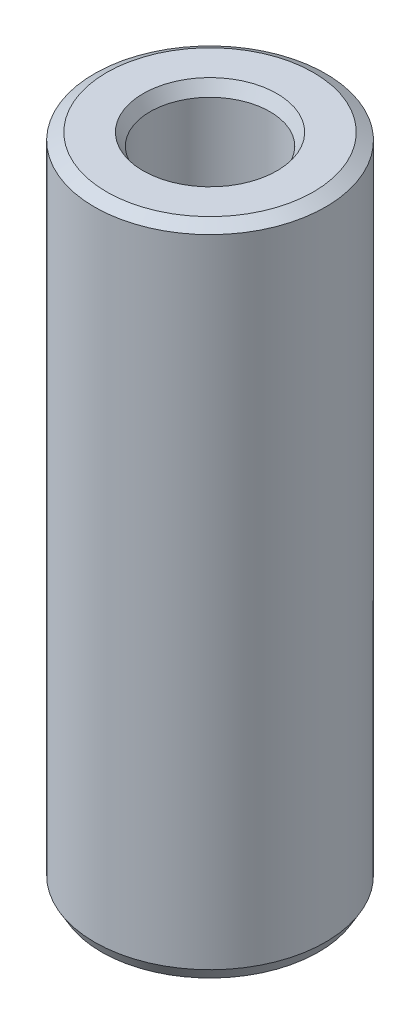
ISO-10303-21;
HEADER;
FILE_DESCRIPTION(('STEP AP214'),'2;1');
FILE_NAME('part.step','',(''),(''),'','','');
FILE_SCHEMA(('AUTOMOTIVE_DESIGN { 1 0 10303 214 1 1 1 1 }'));
ENDSEC;
DATA;
#1=APPLICATION_CONTEXT('core data for automotive mechanical design processes');
#2=APPLICATION_PROTOCOL_DEFINITION('international standard','automotive_design',2000,#1);
#3=PRODUCT_CONTEXT('',#1,'mechanical');
#4=PRODUCT('Part','Part','',(#3));
#5=PRODUCT_RELATED_PRODUCT_CATEGORY('part','',(#4));
#6=PRODUCT_DEFINITION_FORMATION('','',#4);
#7=PRODUCT_DEFINITION_CONTEXT('part definition',#1,'design');
#8=PRODUCT_DEFINITION('design','',#6,#7);
#9=PRODUCT_DEFINITION_SHAPE('','',#8);
#10=(LENGTH_UNIT() NAMED_UNIT(*) SI_UNIT(.MILLI.,.METRE.));
#11=(NAMED_UNIT(*) PLANE_ANGLE_UNIT() SI_UNIT($,.RADIAN.));
#12=(NAMED_UNIT(*) SI_UNIT($,.STERADIAN.) SOLID_ANGLE_UNIT());
#13=UNCERTAINTY_MEASURE_WITH_UNIT(LENGTH_MEASURE(1.E-05),#10,'distance_accuracy_value','');
#14=(GEOMETRIC_REPRESENTATION_CONTEXT(3) GLOBAL_UNCERTAINTY_ASSIGNED_CONTEXT((#13)) GLOBAL_UNIT_ASSIGNED_CONTEXT((#10,
#11,#12)) REPRESENTATION_CONTEXT('',''));
#15=CARTESIAN_POINT('',(0.,0.,0.));
#16=DIRECTION('',(0.,0.,1.));
#17=DIRECTION('',(1.,0.,0.));
#18=AXIS2_PLACEMENT_3D('',#15,#16,#17);
#19=CARTESIAN_POINT('',(0.,113.487181821992,0.));
#20=DIRECTION('',(0.,-1.,0.));
#21=DIRECTION('',(0.,0.,-1.));
#22=AXIS2_PLACEMENT_3D('',#19,#20,#21);
#23=CYLINDRICAL_SURFACE('',#22,20.);
#24=CARTESIAN_POINT('',(0.,2.10228948765961,0.));
#25=DIRECTION('',(0.,1.,0.));
#26=DIRECTION('',(0.,0.,1.));
#27=AXIS2_PLACEMENT_3D('',#24,#25,#26);
#28=CIRCLE('',#27,20.);
#29=CARTESIAN_POINT('',(0.,2.10228948765961,20.));
#30=VERTEX_POINT('',#29);
#31=EDGE_CURVE('E10',#30,#30,#28,.T.);
#32=ORIENTED_EDGE('',*,*,#31,.T.);
#33=EDGE_LOOP('',(#32));
#34=FACE_BOUND('',#33,.T.);
#35=CARTESIAN_POINT('',(0.,112.273424420377,0.));
#36=DIRECTION('',(0.,1.,0.));
#37=DIRECTION('',(0.,0.,1.));
#38=AXIS2_PLACEMENT_3D('',#35,#36,#37);
#39=CIRCLE('',#38,20.);
#40=CARTESIAN_POINT('',(0.,112.273424420377,20.));
#41=VERTEX_POINT('',#40);
#42=EDGE_CURVE('E50',#41,#41,#39,.F.);
#43=ORIENTED_EDGE('',*,*,#42,.T.);
#44=EDGE_LOOP('',(#43));
#45=FACE_BOUND('',#44,.T.);
#46=ADVANCED_FACE('F39',(#34,#45),#23,.T.);
#47=CARTESIAN_POINT('',(0.,113.487181821992,0.));
#48=DIRECTION('',(0.,1.,0.));
#49=DIRECTION('',(0.,0.,1.));
#50=AXIS2_PLACEMENT_3D('',#47,#48,#49);
#51=PLANE('',#50);
#52=CARTESIAN_POINT('',(0.,113.487181821992,0.));
#53=DIRECTION('',(0.,1.,0.));
#54=DIRECTION('',(0.,0.,1.));
#55=AXIS2_PLACEMENT_3D('',#52,#53,#54);
#56=CIRCLE('',#55,11.58377406442);
#57=CARTESIAN_POINT('',(0.,113.487181821992,11.58377406442));
#58=VERTEX_POINT('',#57);
#59=EDGE_CURVE('E58',#58,#58,#56,.F.);
#60=ORIENTED_EDGE('',*,*,#59,.T.);
#61=EDGE_LOOP('',(#60));
#62=FACE_BOUND('',#61,.T.);
#63=CARTESIAN_POINT('',(0.,113.487181821992,0.));
#64=DIRECTION('',(0.,1.,0.));
#65=DIRECTION('',(0.,0.,1.));
#66=AXIS2_PLACEMENT_3D('',#63,#64,#65);
#67=CIRCLE('',#66,17.8977105123403);
#68=CARTESIAN_POINT('',(0.,113.487181821992,17.8977105123403));
#69=VERTEX_POINT('',#68);
#70=EDGE_CURVE('E61',#69,#69,#67,.T.);
#71=ORIENTED_EDGE('',*,*,#70,.T.);
#72=EDGE_LOOP('',(#71));
#73=FACE_BOUND('',#72,.T.);
#74=ADVANCED_FACE('F88',(#62,#73),#51,.T.);
#75=CARTESIAN_POINT('',(0.,0.,0.));
#76=DIRECTION('',(0.,1.,0.));
#77=DIRECTION('',(0.,0.,1.));
#78=AXIS2_PLACEMENT_3D('',#75,#76,#77);
#79=PLANE('',#78);
#80=CARTESIAN_POINT('',(0.,0.,0.));
#81=DIRECTION('',(0.,1.,0.));
#82=DIRECTION('',(0.,0.,1.));
#83=AXIS2_PLACEMENT_3D('',#80,#81,#82);
#84=CIRCLE('',#83,12.4723061504648);
#85=CARTESIAN_POINT('',(0.,0.,12.4723061504648));
#86=VERTEX_POINT('',#85);
#87=EDGE_CURVE('E51',#86,#86,#84,.T.);
#88=ORIENTED_EDGE('',*,*,#87,.T.);
#89=EDGE_LOOP('',(#88));
#90=FACE_BOUND('',#89,.T.);
#91=CARTESIAN_POINT('',(0.,0.,0.));
#92=DIRECTION('',(0.,1.,0.));
#93=DIRECTION('',(0.,0.,1.));
#94=AXIS2_PLACEMENT_3D('',#91,#92,#93);
#95=CIRCLE('',#94,18.7862425983852);
#96=CARTESIAN_POINT('',(0.,0.,18.7862425983852));
#97=VERTEX_POINT('',#96);
#98=EDGE_CURVE('E54',#97,#97,#95,.F.);
#99=ORIENTED_EDGE('',*,*,#98,.T.);
#100=EDGE_LOOP('',(#99));
#101=FACE_BOUND('',#100,.T.);
#102=ADVANCED_FACE('F83',(#90,#101),#79,.F.);
#103=CARTESIAN_POINT('',(0.,113.487181821992,0.));
#104=DIRECTION('',(0.,-1.,0.));
#105=DIRECTION('',(0.,0.,-1.));
#106=AXIS2_PLACEMENT_3D('',#103,#104,#105);
#107=CYLINDRICAL_SURFACE('',#106,10.3700166628051);
#108=CARTESIAN_POINT('',(0.,111.384892334332,0.));
#109=DIRECTION('',(0.,1.,0.));
#110=DIRECTION('',(0.,0.,1.));
#111=AXIS2_PLACEMENT_3D('',#108,#109,#110);
#112=CIRCLE('',#111,10.3700166628051);
#113=CARTESIAN_POINT('',(0.,111.384892334332,10.3700166628051));
#114=VERTEX_POINT('',#113);
#115=EDGE_CURVE('E67',#114,#114,#112,.T.);
#116=ORIENTED_EDGE('',*,*,#115,.T.);
#117=EDGE_LOOP('',(#116));
#118=FACE_BOUND('',#117,.T.);
#119=CARTESIAN_POINT('',(0.,1.21375740161483,0.));
#120=DIRECTION('',(0.,1.,0.));
#121=DIRECTION('',(0.,0.,1.));
#122=AXIS2_PLACEMENT_3D('',#119,#120,#121);
#123=CIRCLE('',#122,10.3700166628051);
#124=CARTESIAN_POINT('',(0.,1.21375740161483,10.3700166628051));
#125=VERTEX_POINT('',#124);
#126=EDGE_CURVE('E69',#125,#125,#123,.F.);
#127=ORIENTED_EDGE('',*,*,#126,.T.);
#128=EDGE_LOOP('',(#127));
#129=FACE_BOUND('',#128,.T.);
#130=ADVANCED_FACE('F71',(#118,#129),#107,.F.);
#131=CARTESIAN_POINT('',(0.,111.384892334332,0.));
#132=DIRECTION('',(0.,1.,0.));
#133=DIRECTION('',(0.,0.,1.));
#134=AXIS2_PLACEMENT_3D('',#131,#132,#133);
#135=CONICAL_SURFACE('',#134,10.3700166628051,0.523598775598299);
#136=ORIENTED_EDGE('',*,*,#59,.F.);
#137=EDGE_LOOP('',(#136));
#138=FACE_BOUND('',#137,.T.);
#139=ORIENTED_EDGE('',*,*,#115,.F.);
#140=EDGE_LOOP('',(#139));
#141=FACE_BOUND('',#140,.T.);
#142=ADVANCED_FACE('F77',(#138,#141),#135,.F.);
#143=CARTESIAN_POINT('',(0.,0.,0.));
#144=DIRECTION('',(0.,-1.,0.));
#145=DIRECTION('',(0.,0.,-1.));
#146=AXIS2_PLACEMENT_3D('',#143,#144,#145);
#147=CONICAL_SURFACE('',#146,12.4723061504648,1.04719755119659);
#148=ORIENTED_EDGE('',*,*,#126,.F.);
#149=EDGE_LOOP('',(#148));
#150=FACE_BOUND('',#149,.T.);
#151=ORIENTED_EDGE('',*,*,#87,.F.);
#152=EDGE_LOOP('',(#151));
#153=FACE_BOUND('',#152,.T.);
#154=ADVANCED_FACE('F73',(#150,#153),#147,.F.);
#155=CARTESIAN_POINT('',(0.,2.10228948765961,0.));
#156=DIRECTION('',(0.,1.,0.));
#157=DIRECTION('',(0.,0.,1.));
#158=AXIS2_PLACEMENT_3D('',#155,#156,#157);
#159=CONICAL_SURFACE('',#158,20.,0.523598775598305);
#160=ORIENTED_EDGE('',*,*,#98,.F.);
#161=EDGE_LOOP('',(#160));
#162=FACE_BOUND('',#161,.T.);
#163=ORIENTED_EDGE('',*,*,#31,.F.);
#164=EDGE_LOOP('',(#163));
#165=FACE_BOUND('',#164,.T.);
#166=ADVANCED_FACE('F76',(#162,#165),#159,.T.);
#167=CARTESIAN_POINT('',(0.,113.487181821992,0.));
#168=DIRECTION('',(0.,-1.,0.));
#169=DIRECTION('',(0.,0.,-1.));
#170=AXIS2_PLACEMENT_3D('',#167,#168,#169);
#171=CONICAL_SURFACE('',#170,17.8977105123403,1.0471975511966);
#172=ORIENTED_EDGE('',*,*,#42,.F.);
#173=EDGE_LOOP('',(#172));
#174=FACE_BOUND('',#173,.T.);
#175=ORIENTED_EDGE('',*,*,#70,.F.);
#176=EDGE_LOOP('',(#175));
#177=FACE_BOUND('',#176,.T.);
#178=ADVANCED_FACE('F45',(#174,#177),#171,.T.);
#179=CLOSED_SHELL('',(#46,#74,#102,#130,#142,#154,#166,#178));
#180=MANIFOLD_SOLID_BREP('B2',#179);
#181=ADVANCED_BREP_SHAPE_REPRESENTATION('',(#18,#180),#14);
#182=SHAPE_DEFINITION_REPRESENTATION(#9,#181);
ENDSEC;
END-ISO-10303-21;
